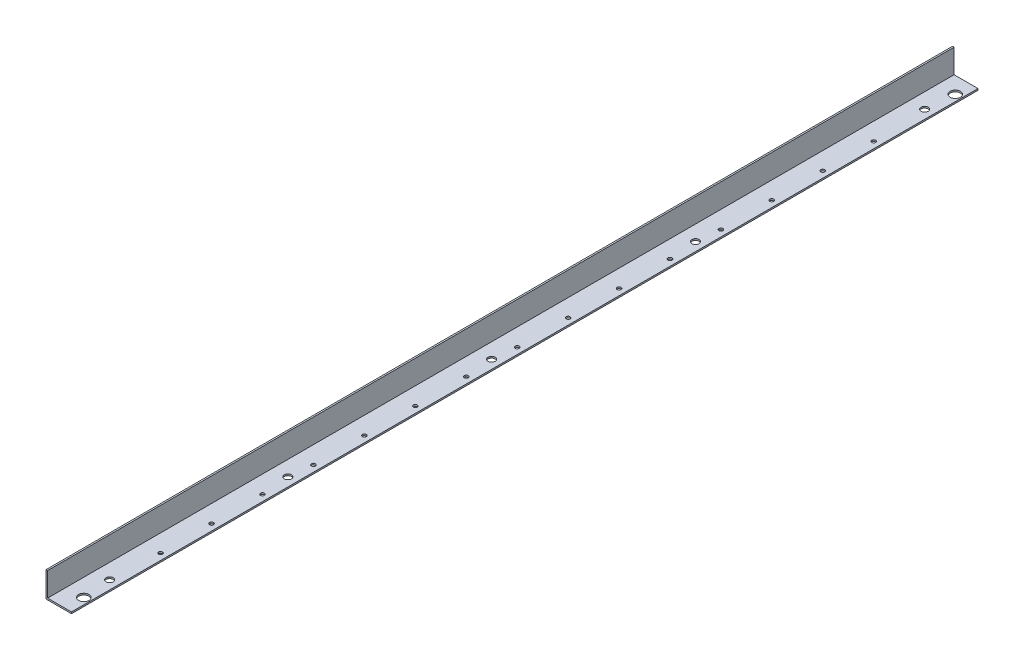
ISO-10303-21;
HEADER;
FILE_DESCRIPTION(('STEP AP214'),'2;1');
FILE_NAME('part.step','',(''),(''),'','','');
FILE_SCHEMA(('AUTOMOTIVE_DESIGN { 1 0 10303 214 1 1 1 1 }'));
ENDSEC;
DATA;
#1=APPLICATION_CONTEXT('core data for automotive mechanical design processes');
#2=APPLICATION_PROTOCOL_DEFINITION('international standard','automotive_design',2000,#1);
#3=PRODUCT_CONTEXT('',#1,'mechanical');
#4=PRODUCT('Part','Part','',(#3));
#5=PRODUCT_RELATED_PRODUCT_CATEGORY('part','',(#4));
#6=PRODUCT_DEFINITION_FORMATION('','',#4);
#7=PRODUCT_DEFINITION_CONTEXT('part definition',#1,'design');
#8=PRODUCT_DEFINITION('design','',#6,#7);
#9=PRODUCT_DEFINITION_SHAPE('','',#8);
#10=(LENGTH_UNIT() NAMED_UNIT(*) SI_UNIT(.MILLI.,.METRE.));
#11=(NAMED_UNIT(*) PLANE_ANGLE_UNIT() SI_UNIT($,.RADIAN.));
#12=(NAMED_UNIT(*) SI_UNIT($,.STERADIAN.) SOLID_ANGLE_UNIT());
#13=UNCERTAINTY_MEASURE_WITH_UNIT(LENGTH_MEASURE(1.E-05),#10,'distance_accuracy_value','');
#14=(GEOMETRIC_REPRESENTATION_CONTEXT(3) GLOBAL_UNCERTAINTY_ASSIGNED_CONTEXT((#13)) GLOBAL_UNIT_ASSIGNED_CONTEXT((#10,
#11,#12)) REPRESENTATION_CONTEXT('',''));
#15=CARTESIAN_POINT('',(0.,0.,0.));
#16=DIRECTION('',(0.,0.,1.));
#17=DIRECTION('',(1.,0.,0.));
#18=AXIS2_PLACEMENT_3D('',#15,#16,#17);
#19=CARTESIAN_POINT('',(38.1,0.,866.775));
#20=DIRECTION('',(0.,1.,0.));
#21=DIRECTION('',(0.,0.,1.));
#22=AXIS2_PLACEMENT_3D('',#19,#20,#21);
#23=CYLINDRICAL_SURFACE('',#22,10.31875);
#24=CARTESIAN_POINT('',(38.1,3.175,866.775));
#25=DIRECTION('',(0.,1.,0.));
#26=DIRECTION('',(0.,0.,1.));
#27=AXIS2_PLACEMENT_3D('',#24,#25,#26);
#28=CIRCLE('',#27,10.31875);
#29=CARTESIAN_POINT('',(38.1,3.175,877.09375));
#30=VERTEX_POINT('',#29);
#31=EDGE_CURVE('E20',#30,#30,#28,.F.);
#32=ORIENTED_EDGE('',*,*,#31,.F.);
#33=EDGE_LOOP('',(#32));
#34=FACE_BOUND('',#33,.T.);
#35=CARTESIAN_POINT('',(38.1,0.,866.775));
#36=DIRECTION('',(0.,1.,0.));
#37=DIRECTION('',(0.,0.,1.));
#38=AXIS2_PLACEMENT_3D('',#35,#36,#37);
#39=CIRCLE('',#38,10.31875);
#40=CARTESIAN_POINT('',(38.1,0.,877.09375));
#41=VERTEX_POINT('',#40);
#42=EDGE_CURVE('E101',#41,#41,#39,.T.);
#43=ORIENTED_EDGE('',*,*,#42,.F.);
#44=EDGE_LOOP('',(#43));
#45=FACE_BOUND('',#44,.T.);
#46=ADVANCED_FACE('F17',(#34,#45),#23,.F.);
#47=CARTESIAN_POINT('',(38.1,0.,-871.5375));
#48=DIRECTION('',(0.,1.,0.));
#49=DIRECTION('',(0.,0.,1.));
#50=AXIS2_PLACEMENT_3D('',#47,#48,#49);
#51=CYLINDRICAL_SURFACE('',#50,10.31875);
#52=CARTESIAN_POINT('',(38.1,3.175,-871.5375));
#53=DIRECTION('',(0.,1.,0.));
#54=DIRECTION('',(0.,0.,1.));
#55=AXIS2_PLACEMENT_3D('',#52,#53,#54);
#56=CIRCLE('',#55,10.31875);
#57=CARTESIAN_POINT('',(38.1,3.175,-861.21875));
#58=VERTEX_POINT('',#57);
#59=EDGE_CURVE('E223',#58,#58,#56,.F.);
#60=ORIENTED_EDGE('',*,*,#59,.F.);
#61=EDGE_LOOP('',(#60));
#62=FACE_BOUND('',#61,.T.);
#63=CARTESIAN_POINT('',(38.1,0.,-871.5375));
#64=DIRECTION('',(0.,1.,0.));
#65=DIRECTION('',(0.,0.,1.));
#66=AXIS2_PLACEMENT_3D('',#63,#64,#65);
#67=CIRCLE('',#66,10.31875);
#68=CARTESIAN_POINT('',(38.1,0.,-861.21875));
#69=VERTEX_POINT('',#68);
#70=EDGE_CURVE('E160',#69,#69,#67,.T.);
#71=ORIENTED_EDGE('',*,*,#70,.F.);
#72=EDGE_LOOP('',(#71));
#73=FACE_BOUND('',#72,.T.);
#74=ADVANCED_FACE('F233',(#62,#73),#51,.F.);
#75=CARTESIAN_POINT('',(33.3375,0.,810.41875));
#76=DIRECTION('',(0.,1.,0.));
#77=DIRECTION('',(0.,0.,1.));
#78=AXIS2_PLACEMENT_3D('',#75,#76,#77);
#79=CYLINDRICAL_SURFACE('',#78,7.14375);
#80=CARTESIAN_POINT('',(33.3375,3.175,810.41875));
#81=DIRECTION('',(0.,1.,0.));
#82=DIRECTION('',(0.,0.,1.));
#83=AXIS2_PLACEMENT_3D('',#80,#81,#82);
#84=CIRCLE('',#83,7.14375);
#85=CARTESIAN_POINT('',(33.3375,3.175,817.5625));
#86=VERTEX_POINT('',#85);
#87=EDGE_CURVE('E221',#86,#86,#84,.F.);
#88=ORIENTED_EDGE('',*,*,#87,.F.);
#89=EDGE_LOOP('',(#88));
#90=FACE_BOUND('',#89,.T.);
#91=CARTESIAN_POINT('',(33.3375,0.,810.41875));
#92=DIRECTION('',(0.,1.,0.));
#93=DIRECTION('',(0.,0.,1.));
#94=AXIS2_PLACEMENT_3D('',#91,#92,#93);
#95=CIRCLE('',#94,7.14375);
#96=CARTESIAN_POINT('',(33.3375,0.,817.5625));
#97=VERTEX_POINT('',#96);
#98=EDGE_CURVE('E157',#97,#97,#95,.T.);
#99=ORIENTED_EDGE('',*,*,#98,.F.);
#100=EDGE_LOOP('',(#99));
#101=FACE_BOUND('',#100,.T.);
#102=ADVANCED_FACE('F527',(#90,#101),#79,.F.);
#103=CARTESIAN_POINT('',(33.3375,0.,454.81875));
#104=DIRECTION('',(0.,1.,0.));
#105=DIRECTION('',(0.,0.,1.));
#106=AXIS2_PLACEMENT_3D('',#103,#104,#105);
#107=CYLINDRICAL_SURFACE('',#106,7.14375);
#108=CARTESIAN_POINT('',(33.3375,3.175,454.81875));
#109=DIRECTION('',(0.,1.,0.));
#110=DIRECTION('',(0.,0.,1.));
#111=AXIS2_PLACEMENT_3D('',#108,#109,#110);
#112=CIRCLE('',#111,7.14375);
#113=CARTESIAN_POINT('',(33.3375,3.175,461.9625));
#114=VERTEX_POINT('',#113);
#115=EDGE_CURVE('E218',#114,#114,#112,.F.);
#116=ORIENTED_EDGE('',*,*,#115,.F.);
#117=EDGE_LOOP('',(#116));
#118=FACE_BOUND('',#117,.T.);
#119=CARTESIAN_POINT('',(33.3375,0.,454.81875));
#120=DIRECTION('',(0.,1.,0.));
#121=DIRECTION('',(0.,0.,1.));
#122=AXIS2_PLACEMENT_3D('',#119,#120,#121);
#123=CIRCLE('',#122,7.14375);
#124=CARTESIAN_POINT('',(33.3375,0.,461.9625));
#125=VERTEX_POINT('',#124);
#126=EDGE_CURVE('E154',#125,#125,#123,.T.);
#127=ORIENTED_EDGE('',*,*,#126,.F.);
#128=EDGE_LOOP('',(#127));
#129=FACE_BOUND('',#128,.T.);
#130=ADVANCED_FACE('F517',(#118,#129),#107,.F.);
#131=CARTESIAN_POINT('',(33.3375,0.,48.64735));
#132=DIRECTION('',(0.,1.,0.));
#133=DIRECTION('',(0.,0.,1.));
#134=AXIS2_PLACEMENT_3D('',#131,#132,#133);
#135=CYLINDRICAL_SURFACE('',#134,7.14375);
#136=CARTESIAN_POINT('',(33.3375,3.175,48.64735));
#137=DIRECTION('',(0.,1.,0.));
#138=DIRECTION('',(0.,0.,1.));
#139=AXIS2_PLACEMENT_3D('',#136,#137,#138);
#140=CIRCLE('',#139,7.14375);
#141=CARTESIAN_POINT('',(33.3375,3.175,55.7911));
#142=VERTEX_POINT('',#141);
#143=EDGE_CURVE('E215',#142,#142,#140,.F.);
#144=ORIENTED_EDGE('',*,*,#143,.F.);
#145=EDGE_LOOP('',(#144));
#146=FACE_BOUND('',#145,.T.);
#147=CARTESIAN_POINT('',(33.3375,0.,48.64735));
#148=DIRECTION('',(0.,1.,0.));
#149=DIRECTION('',(0.,0.,1.));
#150=AXIS2_PLACEMENT_3D('',#147,#148,#149);
#151=CIRCLE('',#150,7.14375);
#152=CARTESIAN_POINT('',(33.3375,0.,55.7911));
#153=VERTEX_POINT('',#152);
#154=EDGE_CURVE('E151',#153,#153,#151,.T.);
#155=ORIENTED_EDGE('',*,*,#154,.F.);
#156=EDGE_LOOP('',(#155));
#157=FACE_BOUND('',#156,.T.);
#158=ADVANCED_FACE('F507',(#146,#157),#135,.F.);
#159=CARTESIAN_POINT('',(33.3375,0.,-357.98125));
#160=DIRECTION('',(0.,1.,0.));
#161=DIRECTION('',(0.,0.,1.));
#162=AXIS2_PLACEMENT_3D('',#159,#160,#161);
#163=CYLINDRICAL_SURFACE('',#162,7.14375);
#164=CARTESIAN_POINT('',(33.3375,3.175,-357.98125));
#165=DIRECTION('',(0.,1.,0.));
#166=DIRECTION('',(0.,0.,1.));
#167=AXIS2_PLACEMENT_3D('',#164,#165,#166);
#168=CIRCLE('',#167,7.14375);
#169=CARTESIAN_POINT('',(33.3375,3.175,-350.8375));
#170=VERTEX_POINT('',#169);
#171=EDGE_CURVE('E212',#170,#170,#168,.F.);
#172=ORIENTED_EDGE('',*,*,#171,.F.);
#173=EDGE_LOOP('',(#172));
#174=FACE_BOUND('',#173,.T.);
#175=CARTESIAN_POINT('',(33.3375,0.,-357.98125));
#176=DIRECTION('',(0.,1.,0.));
#177=DIRECTION('',(0.,0.,1.));
#178=AXIS2_PLACEMENT_3D('',#175,#176,#177);
#179=CIRCLE('',#178,7.14375);
#180=CARTESIAN_POINT('',(33.3375,0.,-350.8375));
#181=VERTEX_POINT('',#180);
#182=EDGE_CURVE('E148',#181,#181,#179,.T.);
#183=ORIENTED_EDGE('',*,*,#182,.F.);
#184=EDGE_LOOP('',(#183));
#185=FACE_BOUND('',#184,.T.);
#186=ADVANCED_FACE('F497',(#174,#185),#163,.F.);
#187=CARTESIAN_POINT('',(33.3375,0.,-815.18125));
#188=DIRECTION('',(0.,1.,0.));
#189=DIRECTION('',(0.,0.,1.));
#190=AXIS2_PLACEMENT_3D('',#187,#188,#189);
#191=CYLINDRICAL_SURFACE('',#190,7.14375);
#192=CARTESIAN_POINT('',(33.3375,3.175,-815.18125));
#193=DIRECTION('',(0.,1.,0.));
#194=DIRECTION('',(0.,0.,1.));
#195=AXIS2_PLACEMENT_3D('',#192,#193,#194);
#196=CIRCLE('',#195,7.14375);
#197=CARTESIAN_POINT('',(33.3375,3.175,-808.0375));
#198=VERTEX_POINT('',#197);
#199=EDGE_CURVE('E209',#198,#198,#196,.F.);
#200=ORIENTED_EDGE('',*,*,#199,.F.);
#201=EDGE_LOOP('',(#200));
#202=FACE_BOUND('',#201,.T.);
#203=CARTESIAN_POINT('',(33.3375,0.,-815.18125));
#204=DIRECTION('',(0.,1.,0.));
#205=DIRECTION('',(0.,0.,1.));
#206=AXIS2_PLACEMENT_3D('',#203,#204,#205);
#207=CIRCLE('',#206,7.14375);
#208=CARTESIAN_POINT('',(33.3375,0.,-808.0375));
#209=VERTEX_POINT('',#208);
#210=EDGE_CURVE('E145',#209,#209,#207,.T.);
#211=ORIENTED_EDGE('',*,*,#210,.F.);
#212=EDGE_LOOP('',(#211));
#213=FACE_BOUND('',#212,.T.);
#214=ADVANCED_FACE('F487',(#202,#213),#191,.F.);
#215=CARTESIAN_POINT('',(38.1,0.,-708.81875));
#216=DIRECTION('',(0.,-1.,0.));
#217=DIRECTION('',(0.,0.,-1.));
#218=AXIS2_PLACEMENT_3D('',#215,#216,#217);
#219=CYLINDRICAL_SURFACE('',#218,3.96875);
#220=CARTESIAN_POINT('',(38.1,3.175,-708.81875));
#221=DIRECTION('',(0.,-1.,0.));
#222=DIRECTION('',(0.,0.,-1.));
#223=AXIS2_PLACEMENT_3D('',#220,#221,#222);
#224=CIRCLE('',#223,3.96875);
#225=CARTESIAN_POINT('',(38.1,3.175,-712.7875));
#226=VERTEX_POINT('',#225);
#227=EDGE_CURVE('E206',#226,#226,#224,.T.);
#228=ORIENTED_EDGE('',*,*,#227,.F.);
#229=EDGE_LOOP('',(#228));
#230=FACE_BOUND('',#229,.T.);
#231=CARTESIAN_POINT('',(38.1,0.,-708.81875));
#232=DIRECTION('',(0.,-1.,0.));
#233=DIRECTION('',(0.,0.,-1.));
#234=AXIS2_PLACEMENT_3D('',#231,#232,#233);
#235=CIRCLE('',#234,3.96875);
#236=CARTESIAN_POINT('',(38.1,0.,-712.7875));
#237=VERTEX_POINT('',#236);
#238=EDGE_CURVE('E142',#237,#237,#235,.F.);
#239=ORIENTED_EDGE('',*,*,#238,.F.);
#240=EDGE_LOOP('',(#239));
#241=FACE_BOUND('',#240,.T.);
#242=ADVANCED_FACE('F477',(#230,#241),#219,.F.);
#243=CARTESIAN_POINT('',(38.1,0.,-607.21875));
#244=DIRECTION('',(0.,-1.,0.));
#245=DIRECTION('',(0.,0.,-1.));
#246=AXIS2_PLACEMENT_3D('',#243,#244,#245);
#247=CYLINDRICAL_SURFACE('',#246,3.96875);
#248=CARTESIAN_POINT('',(38.1,3.175,-607.21875));
#249=DIRECTION('',(0.,-1.,0.));
#250=DIRECTION('',(0.,0.,-1.));
#251=AXIS2_PLACEMENT_3D('',#248,#249,#250);
#252=CIRCLE('',#251,3.96875);
#253=CARTESIAN_POINT('',(38.1,3.175,-611.1875));
#254=VERTEX_POINT('',#253);
#255=EDGE_CURVE('E203',#254,#254,#252,.T.);
#256=ORIENTED_EDGE('',*,*,#255,.F.);
#257=EDGE_LOOP('',(#256));
#258=FACE_BOUND('',#257,.T.);
#259=CARTESIAN_POINT('',(38.1,0.,-607.21875));
#260=DIRECTION('',(0.,-1.,0.));
#261=DIRECTION('',(0.,0.,-1.));
#262=AXIS2_PLACEMENT_3D('',#259,#260,#261);
#263=CIRCLE('',#262,3.96875);
#264=CARTESIAN_POINT('',(38.1,0.,-611.1875));
#265=VERTEX_POINT('',#264);
#266=EDGE_CURVE('E139',#265,#265,#263,.F.);
#267=ORIENTED_EDGE('',*,*,#266,.F.);
#268=EDGE_LOOP('',(#267));
#269=FACE_BOUND('',#268,.T.);
#270=ADVANCED_FACE('F467',(#258,#269),#247,.F.);
#271=CARTESIAN_POINT('',(38.1,0.,-505.61875));
#272=DIRECTION('',(0.,-1.,0.));
#273=DIRECTION('',(0.,0.,-1.));
#274=AXIS2_PLACEMENT_3D('',#271,#272,#273);
#275=CYLINDRICAL_SURFACE('',#274,3.96875);
#276=CARTESIAN_POINT('',(38.1,3.175,-505.61875));
#277=DIRECTION('',(0.,-1.,0.));
#278=DIRECTION('',(0.,0.,-1.));
#279=AXIS2_PLACEMENT_3D('',#276,#277,#278);
#280=CIRCLE('',#279,3.96875);
#281=CARTESIAN_POINT('',(38.1,3.175,-509.5875));
#282=VERTEX_POINT('',#281);
#283=EDGE_CURVE('E200',#282,#282,#280,.T.);
#284=ORIENTED_EDGE('',*,*,#283,.F.);
#285=EDGE_LOOP('',(#284));
#286=FACE_BOUND('',#285,.T.);
#287=CARTESIAN_POINT('',(38.1,0.,-505.61875));
#288=DIRECTION('',(0.,-1.,0.));
#289=DIRECTION('',(0.,0.,-1.));
#290=AXIS2_PLACEMENT_3D('',#287,#288,#289);
#291=CIRCLE('',#290,3.96875);
#292=CARTESIAN_POINT('',(38.1,0.,-509.5875));
#293=VERTEX_POINT('',#292);
#294=EDGE_CURVE('E136',#293,#293,#291,.F.);
#295=ORIENTED_EDGE('',*,*,#294,.F.);
#296=EDGE_LOOP('',(#295));
#297=FACE_BOUND('',#296,.T.);
#298=ADVANCED_FACE('F457',(#286,#297),#275,.F.);
#299=CARTESIAN_POINT('',(38.1,0.,-404.01875));
#300=DIRECTION('',(0.,-1.,0.));
#301=DIRECTION('',(0.,0.,-1.));
#302=AXIS2_PLACEMENT_3D('',#299,#300,#301);
#303=CYLINDRICAL_SURFACE('',#302,3.96875);
#304=CARTESIAN_POINT('',(38.1,3.175,-404.01875));
#305=DIRECTION('',(0.,-1.,0.));
#306=DIRECTION('',(0.,0.,-1.));
#307=AXIS2_PLACEMENT_3D('',#304,#305,#306);
#308=CIRCLE('',#307,3.96875);
#309=CARTESIAN_POINT('',(38.1,3.175,-407.9875));
#310=VERTEX_POINT('',#309);
#311=EDGE_CURVE('E197',#310,#310,#308,.T.);
#312=ORIENTED_EDGE('',*,*,#311,.F.);
#313=EDGE_LOOP('',(#312));
#314=FACE_BOUND('',#313,.T.);
#315=CARTESIAN_POINT('',(38.1,0.,-404.01875));
#316=DIRECTION('',(0.,-1.,0.));
#317=DIRECTION('',(0.,0.,-1.));
#318=AXIS2_PLACEMENT_3D('',#315,#316,#317);
#319=CIRCLE('',#318,3.96875);
#320=CARTESIAN_POINT('',(38.1,0.,-407.9875));
#321=VERTEX_POINT('',#320);
#322=EDGE_CURVE('E133',#321,#321,#319,.F.);
#323=ORIENTED_EDGE('',*,*,#322,.F.);
#324=EDGE_LOOP('',(#323));
#325=FACE_BOUND('',#324,.T.);
#326=ADVANCED_FACE('F447',(#314,#325),#303,.F.);
#327=CARTESIAN_POINT('',(38.1,0.,-302.41875));
#328=DIRECTION('',(0.,-1.,0.));
#329=DIRECTION('',(0.,0.,-1.));
#330=AXIS2_PLACEMENT_3D('',#327,#328,#329);
#331=CYLINDRICAL_SURFACE('',#330,3.96875);
#332=CARTESIAN_POINT('',(38.1,3.175,-302.41875));
#333=DIRECTION('',(0.,-1.,0.));
#334=DIRECTION('',(0.,0.,-1.));
#335=AXIS2_PLACEMENT_3D('',#332,#333,#334);
#336=CIRCLE('',#335,3.96875);
#337=CARTESIAN_POINT('',(38.1,3.175,-306.3875));
#338=VERTEX_POINT('',#337);
#339=EDGE_CURVE('E194',#338,#338,#336,.T.);
#340=ORIENTED_EDGE('',*,*,#339,.F.);
#341=EDGE_LOOP('',(#340));
#342=FACE_BOUND('',#341,.T.);
#343=CARTESIAN_POINT('',(38.1,0.,-302.41875));
#344=DIRECTION('',(0.,-1.,0.));
#345=DIRECTION('',(0.,0.,-1.));
#346=AXIS2_PLACEMENT_3D('',#343,#344,#345);
#347=CIRCLE('',#346,3.96875);
#348=CARTESIAN_POINT('',(38.1,0.,-306.3875));
#349=VERTEX_POINT('',#348);
#350=EDGE_CURVE('E130',#349,#349,#347,.F.);
#351=ORIENTED_EDGE('',*,*,#350,.F.);
#352=EDGE_LOOP('',(#351));
#353=FACE_BOUND('',#352,.T.);
#354=ADVANCED_FACE('F437',(#342,#353),#331,.F.);
#355=CARTESIAN_POINT('',(38.1,0.,-200.81875));
#356=DIRECTION('',(0.,-1.,0.));
#357=DIRECTION('',(0.,0.,-1.));
#358=AXIS2_PLACEMENT_3D('',#355,#356,#357);
#359=CYLINDRICAL_SURFACE('',#358,3.96875);
#360=CARTESIAN_POINT('',(38.1,3.175,-200.81875));
#361=DIRECTION('',(0.,-1.,0.));
#362=DIRECTION('',(0.,0.,-1.));
#363=AXIS2_PLACEMENT_3D('',#360,#361,#362);
#364=CIRCLE('',#363,3.96875);
#365=CARTESIAN_POINT('',(38.1,3.175,-204.7875));
#366=VERTEX_POINT('',#365);
#367=EDGE_CURVE('E191',#366,#366,#364,.T.);
#368=ORIENTED_EDGE('',*,*,#367,.F.);
#369=EDGE_LOOP('',(#368));
#370=FACE_BOUND('',#369,.T.);
#371=CARTESIAN_POINT('',(38.1,0.,-200.81875));
#372=DIRECTION('',(0.,-1.,0.));
#373=DIRECTION('',(0.,0.,-1.));
#374=AXIS2_PLACEMENT_3D('',#371,#372,#373);
#375=CIRCLE('',#374,3.96875);
#376=CARTESIAN_POINT('',(38.1,0.,-204.7875));
#377=VERTEX_POINT('',#376);
#378=EDGE_CURVE('E127',#377,#377,#375,.F.);
#379=ORIENTED_EDGE('',*,*,#378,.F.);
#380=EDGE_LOOP('',(#379));
#381=FACE_BOUND('',#380,.T.);
#382=ADVANCED_FACE('F427',(#370,#381),#359,.F.);
#383=CARTESIAN_POINT('',(38.1,0.,-99.21875));
#384=DIRECTION('',(0.,-1.,0.));
#385=DIRECTION('',(0.,0.,-1.));
#386=AXIS2_PLACEMENT_3D('',#383,#384,#385);
#387=CYLINDRICAL_SURFACE('',#386,3.96875);
#388=CARTESIAN_POINT('',(38.1,3.175,-99.21875));
#389=DIRECTION('',(0.,-1.,0.));
#390=DIRECTION('',(0.,0.,-1.));
#391=AXIS2_PLACEMENT_3D('',#388,#389,#390);
#392=CIRCLE('',#391,3.96875);
#393=CARTESIAN_POINT('',(38.1,3.175,-103.1875));
#394=VERTEX_POINT('',#393);
#395=EDGE_CURVE('E188',#394,#394,#392,.T.);
#396=ORIENTED_EDGE('',*,*,#395,.F.);
#397=EDGE_LOOP('',(#396));
#398=FACE_BOUND('',#397,.T.);
#399=CARTESIAN_POINT('',(38.1,0.,-99.21875));
#400=DIRECTION('',(0.,-1.,0.));
#401=DIRECTION('',(0.,0.,-1.));
#402=AXIS2_PLACEMENT_3D('',#399,#400,#401);
#403=CIRCLE('',#402,3.96875);
#404=CARTESIAN_POINT('',(38.1,0.,-103.1875));
#405=VERTEX_POINT('',#404);
#406=EDGE_CURVE('E124',#405,#405,#403,.F.);
#407=ORIENTED_EDGE('',*,*,#406,.F.);
#408=EDGE_LOOP('',(#407));
#409=FACE_BOUND('',#408,.T.);
#410=ADVANCED_FACE('F417',(#398,#409),#387,.F.);
#411=CARTESIAN_POINT('',(38.1,0.,2.38125));
#412=DIRECTION('',(0.,-1.,0.));
#413=DIRECTION('',(0.,0.,-1.));
#414=AXIS2_PLACEMENT_3D('',#411,#412,#413);
#415=CYLINDRICAL_SURFACE('',#414,3.96875);
#416=CARTESIAN_POINT('',(38.1,3.175,2.38125));
#417=DIRECTION('',(0.,-1.,0.));
#418=DIRECTION('',(0.,0.,-1.));
#419=AXIS2_PLACEMENT_3D('',#416,#417,#418);
#420=CIRCLE('',#419,3.96875);
#421=CARTESIAN_POINT('',(38.1,3.175,-1.5875));
#422=VERTEX_POINT('',#421);
#423=EDGE_CURVE('E185',#422,#422,#420,.T.);
#424=ORIENTED_EDGE('',*,*,#423,.F.);
#425=EDGE_LOOP('',(#424));
#426=FACE_BOUND('',#425,.T.);
#427=CARTESIAN_POINT('',(38.1,0.,2.38125));
#428=DIRECTION('',(0.,-1.,0.));
#429=DIRECTION('',(0.,0.,-1.));
#430=AXIS2_PLACEMENT_3D('',#427,#428,#429);
#431=CIRCLE('',#430,3.96875);
#432=CARTESIAN_POINT('',(38.1,0.,-1.5875));
#433=VERTEX_POINT('',#432);
#434=EDGE_CURVE('E121',#433,#433,#431,.F.);
#435=ORIENTED_EDGE('',*,*,#434,.F.);
#436=EDGE_LOOP('',(#435));
#437=FACE_BOUND('',#436,.T.);
#438=ADVANCED_FACE('F407',(#426,#437),#415,.F.);
#439=CARTESIAN_POINT('',(38.1,0.,103.98125));
#440=DIRECTION('',(0.,-1.,0.));
#441=DIRECTION('',(0.,0.,-1.));
#442=AXIS2_PLACEMENT_3D('',#439,#440,#441);
#443=CYLINDRICAL_SURFACE('',#442,3.96875);
#444=CARTESIAN_POINT('',(38.1,3.175,103.98125));
#445=DIRECTION('',(0.,-1.,0.));
#446=DIRECTION('',(0.,0.,-1.));
#447=AXIS2_PLACEMENT_3D('',#444,#445,#446);
#448=CIRCLE('',#447,3.96875);
#449=CARTESIAN_POINT('',(38.1,3.175,100.0125));
#450=VERTEX_POINT('',#449);
#451=EDGE_CURVE('E182',#450,#450,#448,.T.);
#452=ORIENTED_EDGE('',*,*,#451,.F.);
#453=EDGE_LOOP('',(#452));
#454=FACE_BOUND('',#453,.T.);
#455=CARTESIAN_POINT('',(38.1,0.,103.98125));
#456=DIRECTION('',(0.,-1.,0.));
#457=DIRECTION('',(0.,0.,-1.));
#458=AXIS2_PLACEMENT_3D('',#455,#456,#457);
#459=CIRCLE('',#458,3.96875);
#460=CARTESIAN_POINT('',(38.1,0.,100.0125));
#461=VERTEX_POINT('',#460);
#462=EDGE_CURVE('E118',#461,#461,#459,.F.);
#463=ORIENTED_EDGE('',*,*,#462,.F.);
#464=EDGE_LOOP('',(#463));
#465=FACE_BOUND('',#464,.T.);
#466=ADVANCED_FACE('F397',(#454,#465),#443,.F.);
#467=CARTESIAN_POINT('',(38.1,0.,205.58125));
#468=DIRECTION('',(0.,-1.,0.));
#469=DIRECTION('',(0.,0.,-1.));
#470=AXIS2_PLACEMENT_3D('',#467,#468,#469);
#471=CYLINDRICAL_SURFACE('',#470,3.96875);
#472=CARTESIAN_POINT('',(38.1,3.175,205.58125));
#473=DIRECTION('',(0.,-1.,0.));
#474=DIRECTION('',(0.,0.,-1.));
#475=AXIS2_PLACEMENT_3D('',#472,#473,#474);
#476=CIRCLE('',#475,3.96875);
#477=CARTESIAN_POINT('',(38.1,3.175,201.6125));
#478=VERTEX_POINT('',#477);
#479=EDGE_CURVE('E179',#478,#478,#476,.T.);
#480=ORIENTED_EDGE('',*,*,#479,.F.);
#481=EDGE_LOOP('',(#480));
#482=FACE_BOUND('',#481,.T.);
#483=CARTESIAN_POINT('',(38.1,0.,205.58125));
#484=DIRECTION('',(0.,-1.,0.));
#485=DIRECTION('',(0.,0.,-1.));
#486=AXIS2_PLACEMENT_3D('',#483,#484,#485);
#487=CIRCLE('',#486,3.96875);
#488=CARTESIAN_POINT('',(38.1,0.,201.6125));
#489=VERTEX_POINT('',#488);
#490=EDGE_CURVE('E115',#489,#489,#487,.F.);
#491=ORIENTED_EDGE('',*,*,#490,.F.);
#492=EDGE_LOOP('',(#491));
#493=FACE_BOUND('',#492,.T.);
#494=ADVANCED_FACE('F387',(#482,#493),#471,.F.);
#495=CARTESIAN_POINT('',(38.1,0.,307.18125));
#496=DIRECTION('',(0.,-1.,0.));
#497=DIRECTION('',(0.,0.,-1.));
#498=AXIS2_PLACEMENT_3D('',#495,#496,#497);
#499=CYLINDRICAL_SURFACE('',#498,3.96875);
#500=CARTESIAN_POINT('',(38.1,3.175,307.18125));
#501=DIRECTION('',(0.,-1.,0.));
#502=DIRECTION('',(0.,0.,-1.));
#503=AXIS2_PLACEMENT_3D('',#500,#501,#502);
#504=CIRCLE('',#503,3.96875);
#505=CARTESIAN_POINT('',(38.1,3.175,303.2125));
#506=VERTEX_POINT('',#505);
#507=EDGE_CURVE('E176',#506,#506,#504,.T.);
#508=ORIENTED_EDGE('',*,*,#507,.F.);
#509=EDGE_LOOP('',(#508));
#510=FACE_BOUND('',#509,.T.);
#511=CARTESIAN_POINT('',(38.1,0.,307.18125));
#512=DIRECTION('',(0.,-1.,0.));
#513=DIRECTION('',(0.,0.,-1.));
#514=AXIS2_PLACEMENT_3D('',#511,#512,#513);
#515=CIRCLE('',#514,3.96875);
#516=CARTESIAN_POINT('',(38.1,0.,303.2125));
#517=VERTEX_POINT('',#516);
#518=EDGE_CURVE('E112',#517,#517,#515,.F.);
#519=ORIENTED_EDGE('',*,*,#518,.F.);
#520=EDGE_LOOP('',(#519));
#521=FACE_BOUND('',#520,.T.);
#522=ADVANCED_FACE('F377',(#510,#521),#499,.F.);
#523=CARTESIAN_POINT('',(38.1,0.,408.78125));
#524=DIRECTION('',(0.,-1.,0.));
#525=DIRECTION('',(0.,0.,-1.));
#526=AXIS2_PLACEMENT_3D('',#523,#524,#525);
#527=CYLINDRICAL_SURFACE('',#526,3.96875);
#528=CARTESIAN_POINT('',(38.1,3.175,408.78125));
#529=DIRECTION('',(0.,-1.,0.));
#530=DIRECTION('',(0.,0.,-1.));
#531=AXIS2_PLACEMENT_3D('',#528,#529,#530);
#532=CIRCLE('',#531,3.96875);
#533=CARTESIAN_POINT('',(38.1,3.175,404.8125));
#534=VERTEX_POINT('',#533);
#535=EDGE_CURVE('E173',#534,#534,#532,.T.);
#536=ORIENTED_EDGE('',*,*,#535,.F.);
#537=EDGE_LOOP('',(#536));
#538=FACE_BOUND('',#537,.T.);
#539=CARTESIAN_POINT('',(38.1,0.,408.78125));
#540=DIRECTION('',(0.,-1.,0.));
#541=DIRECTION('',(0.,0.,-1.));
#542=AXIS2_PLACEMENT_3D('',#539,#540,#541);
#543=CIRCLE('',#542,3.96875);
#544=CARTESIAN_POINT('',(38.1,0.,404.8125));
#545=VERTEX_POINT('',#544);
#546=EDGE_CURVE('E109',#545,#545,#543,.F.);
#547=ORIENTED_EDGE('',*,*,#546,.F.);
#548=EDGE_LOOP('',(#547));
#549=FACE_BOUND('',#548,.T.);
#550=ADVANCED_FACE('F367',(#538,#549),#527,.F.);
#551=CARTESIAN_POINT('',(38.1,0.,510.38125));
#552=DIRECTION('',(0.,-1.,0.));
#553=DIRECTION('',(0.,0.,-1.));
#554=AXIS2_PLACEMENT_3D('',#551,#552,#553);
#555=CYLINDRICAL_SURFACE('',#554,3.96875);
#556=CARTESIAN_POINT('',(38.1,3.175,510.38125));
#557=DIRECTION('',(0.,-1.,0.));
#558=DIRECTION('',(0.,0.,-1.));
#559=AXIS2_PLACEMENT_3D('',#556,#557,#558);
#560=CIRCLE('',#559,3.96875);
#561=CARTESIAN_POINT('',(38.1,3.175,506.4125));
#562=VERTEX_POINT('',#561);
#563=EDGE_CURVE('E170',#562,#562,#560,.T.);
#564=ORIENTED_EDGE('',*,*,#563,.F.);
#565=EDGE_LOOP('',(#564));
#566=FACE_BOUND('',#565,.T.);
#567=CARTESIAN_POINT('',(38.1,0.,510.38125));
#568=DIRECTION('',(0.,-1.,0.));
#569=DIRECTION('',(0.,0.,-1.));
#570=AXIS2_PLACEMENT_3D('',#567,#568,#569);
#571=CIRCLE('',#570,3.96875);
#572=CARTESIAN_POINT('',(38.1,0.,506.4125));
#573=VERTEX_POINT('',#572);
#574=EDGE_CURVE('E106',#573,#573,#571,.F.);
#575=ORIENTED_EDGE('',*,*,#574,.F.);
#576=EDGE_LOOP('',(#575));
#577=FACE_BOUND('',#576,.T.);
#578=ADVANCED_FACE('F357',(#566,#577),#555,.F.);
#579=CARTESIAN_POINT('',(38.1,0.,611.98125));
#580=DIRECTION('',(0.,-1.,0.));
#581=DIRECTION('',(0.,0.,-1.));
#582=AXIS2_PLACEMENT_3D('',#579,#580,#581);
#583=CYLINDRICAL_SURFACE('',#582,3.96875);
#584=CARTESIAN_POINT('',(38.1,3.175,611.98125));
#585=DIRECTION('',(0.,-1.,0.));
#586=DIRECTION('',(0.,0.,-1.));
#587=AXIS2_PLACEMENT_3D('',#584,#585,#586);
#588=CIRCLE('',#587,3.96875);
#589=CARTESIAN_POINT('',(38.1,3.175,608.0125));
#590=VERTEX_POINT('',#589);
#591=EDGE_CURVE('E167',#590,#590,#588,.T.);
#592=ORIENTED_EDGE('',*,*,#591,.F.);
#593=EDGE_LOOP('',(#592));
#594=FACE_BOUND('',#593,.T.);
#595=CARTESIAN_POINT('',(38.1,0.,611.98125));
#596=DIRECTION('',(0.,-1.,0.));
#597=DIRECTION('',(0.,0.,-1.));
#598=AXIS2_PLACEMENT_3D('',#595,#596,#597);
#599=CIRCLE('',#598,3.96875);
#600=CARTESIAN_POINT('',(38.1,0.,608.0125));
#601=VERTEX_POINT('',#600);
#602=EDGE_CURVE('E95',#601,#601,#599,.F.);
#603=ORIENTED_EDGE('',*,*,#602,.F.);
#604=EDGE_LOOP('',(#603));
#605=FACE_BOUND('',#604,.T.);
#606=ADVANCED_FACE('F347',(#594,#605),#583,.F.);
#607=CARTESIAN_POINT('',(38.1,0.,713.58125));
#608=DIRECTION('',(0.,-1.,0.));
#609=DIRECTION('',(0.,0.,-1.));
#610=AXIS2_PLACEMENT_3D('',#607,#608,#609);
#611=CYLINDRICAL_SURFACE('',#610,3.96875);
#612=CARTESIAN_POINT('',(38.1,3.175,713.58125));
#613=DIRECTION('',(0.,-1.,0.));
#614=DIRECTION('',(0.,0.,-1.));
#615=AXIS2_PLACEMENT_3D('',#612,#613,#614);
#616=CIRCLE('',#615,3.96875);
#617=CARTESIAN_POINT('',(38.1,3.175,709.6125));
#618=VERTEX_POINT('',#617);
#619=EDGE_CURVE('E102',#618,#618,#616,.T.);
#620=ORIENTED_EDGE('',*,*,#619,.F.);
#621=EDGE_LOOP('',(#620));
#622=FACE_BOUND('',#621,.T.);
#623=CARTESIAN_POINT('',(38.1,0.,713.58125));
#624=DIRECTION('',(0.,-1.,0.));
#625=DIRECTION('',(0.,0.,-1.));
#626=AXIS2_PLACEMENT_3D('',#623,#624,#625);
#627=CIRCLE('',#626,3.96875);
#628=CARTESIAN_POINT('',(38.1,0.,709.6125));
#629=VERTEX_POINT('',#628);
#630=EDGE_CURVE('E92',#629,#629,#627,.F.);
#631=ORIENTED_EDGE('',*,*,#630,.F.);
#632=EDGE_LOOP('',(#631));
#633=FACE_BOUND('',#632,.T.);
#634=ADVANCED_FACE('F338',(#622,#633),#611,.F.);
#635=CARTESIAN_POINT('',(50.8,0.,-904.08125));
#636=DIRECTION('',(1.,0.,0.));
#637=DIRECTION('',(0.,0.,-1.));
#638=AXIS2_PLACEMENT_3D('',#635,#636,#637);
#639=PLANE('',#638);
#640=DIRECTION('',(0.,0.,-1.));
#641=VECTOR('',#640,1.);
#642=CARTESIAN_POINT('',(50.8,0.,-904.08125));
#643=LINE('',#642,#641);
#644=CARTESIAN_POINT('',(50.8,0.,-904.08125));
#645=VERTEX_POINT('',#644);
#646=CARTESIAN_POINT('',(50.8,0.,904.08125));
#647=VERTEX_POINT('',#646);
#648=EDGE_CURVE('E99',#645,#647,#643,.F.);
#649=ORIENTED_EDGE('',*,*,#648,.F.);
#650=DIRECTION('',(0.,1.,0.));
#651=VECTOR('',#650,1.);
#652=CARTESIAN_POINT('',(50.8,0.,-904.08125));
#653=LINE('',#652,#651);
#654=CARTESIAN_POINT('',(50.8,3.175,-904.08125));
#655=VERTEX_POINT('',#654);
#656=EDGE_CURVE('E75',#645,#655,#653,.T.);
#657=ORIENTED_EDGE('',*,*,#656,.T.);
#658=DIRECTION('',(0.,0.,1.));
#659=VECTOR('',#658,1.);
#660=CARTESIAN_POINT('',(50.8,3.175,-904.08125));
#661=LINE('',#660,#659);
#662=CARTESIAN_POINT('',(50.8,3.175,904.08125));
#663=VERTEX_POINT('',#662);
#664=EDGE_CURVE('E71',#663,#655,#661,.F.);
#665=ORIENTED_EDGE('',*,*,#664,.F.);
#666=DIRECTION('',(0.,1.,0.));
#667=VECTOR('',#666,1.);
#668=CARTESIAN_POINT('',(50.8,0.,904.08125));
#669=LINE('',#668,#667);
#670=EDGE_CURVE('E68',#647,#663,#669,.T.);
#671=ORIENTED_EDGE('',*,*,#670,.F.);
#672=EDGE_LOOP('',(#649,#657,#665,#671));
#673=FACE_BOUND('',#672,.T.);
#674=ADVANCED_FACE('F73',(#673),#639,.T.);
#675=CARTESIAN_POINT('',(50.8,3.175,-904.08125));
#676=DIRECTION('',(0.,1.,0.));
#677=DIRECTION('',(0.,0.,1.));
#678=AXIS2_PLACEMENT_3D('',#675,#676,#677);
#679=PLANE('',#678);
#680=ORIENTED_EDGE('',*,*,#619,.T.);
#681=EDGE_LOOP('',(#680));
#682=FACE_BOUND('',#681,.T.);
#683=ORIENTED_EDGE('',*,*,#591,.T.);
#684=EDGE_LOOP('',(#683));
#685=FACE_BOUND('',#684,.T.);
#686=ORIENTED_EDGE('',*,*,#563,.T.);
#687=EDGE_LOOP('',(#686));
#688=FACE_BOUND('',#687,.T.);
#689=ORIENTED_EDGE('',*,*,#535,.T.);
#690=EDGE_LOOP('',(#689));
#691=FACE_BOUND('',#690,.T.);
#692=ORIENTED_EDGE('',*,*,#507,.T.);
#693=EDGE_LOOP('',(#692));
#694=FACE_BOUND('',#693,.T.);
#695=ORIENTED_EDGE('',*,*,#479,.T.);
#696=EDGE_LOOP('',(#695));
#697=FACE_BOUND('',#696,.T.);
#698=ORIENTED_EDGE('',*,*,#451,.T.);
#699=EDGE_LOOP('',(#698));
#700=FACE_BOUND('',#699,.T.);
#701=ORIENTED_EDGE('',*,*,#423,.T.);
#702=EDGE_LOOP('',(#701));
#703=FACE_BOUND('',#702,.T.);
#704=ORIENTED_EDGE('',*,*,#395,.T.);
#705=EDGE_LOOP('',(#704));
#706=FACE_BOUND('',#705,.T.);
#707=ORIENTED_EDGE('',*,*,#367,.T.);
#708=EDGE_LOOP('',(#707));
#709=FACE_BOUND('',#708,.T.);
#710=ORIENTED_EDGE('',*,*,#339,.T.);
#711=EDGE_LOOP('',(#710));
#712=FACE_BOUND('',#711,.T.);
#713=ORIENTED_EDGE('',*,*,#311,.T.);
#714=EDGE_LOOP('',(#713));
#715=FACE_BOUND('',#714,.T.);
#716=ORIENTED_EDGE('',*,*,#283,.T.);
#717=EDGE_LOOP('',(#716));
#718=FACE_BOUND('',#717,.T.);
#719=ORIENTED_EDGE('',*,*,#255,.T.);
#720=EDGE_LOOP('',(#719));
#721=FACE_BOUND('',#720,.T.);
#722=ORIENTED_EDGE('',*,*,#227,.T.);
#723=EDGE_LOOP('',(#722));
#724=FACE_BOUND('',#723,.T.);
#725=ORIENTED_EDGE('',*,*,#199,.T.);
#726=EDGE_LOOP('',(#725));
#727=FACE_BOUND('',#726,.T.);
#728=ORIENTED_EDGE('',*,*,#171,.T.);
#729=EDGE_LOOP('',(#728));
#730=FACE_BOUND('',#729,.T.);
#731=ORIENTED_EDGE('',*,*,#143,.T.);
#732=EDGE_LOOP('',(#731));
#733=FACE_BOUND('',#732,.T.);
#734=ORIENTED_EDGE('',*,*,#115,.T.);
#735=EDGE_LOOP('',(#734));
#736=FACE_BOUND('',#735,.T.);
#737=ORIENTED_EDGE('',*,*,#87,.T.);
#738=EDGE_LOOP('',(#737));
#739=FACE_BOUND('',#738,.T.);
#740=ORIENTED_EDGE('',*,*,#59,.T.);
#741=EDGE_LOOP('',(#740));
#742=FACE_BOUND('',#741,.T.);
#743=ORIENTED_EDGE('',*,*,#31,.T.);
#744=EDGE_LOOP('',(#743));
#745=FACE_BOUND('',#744,.T.);
#746=ORIENTED_EDGE('',*,*,#664,.T.);
#747=DIRECTION('',(1.,0.,0.));
#748=VECTOR('',#747,1.);
#749=CARTESIAN_POINT('',(0.,3.175,-904.08125));
#750=LINE('',#749,#748);
#751=CARTESIAN_POINT('',(3.175,3.175,-904.08125));
#752=VERTEX_POINT('',#751);
#753=EDGE_CURVE('E264',#655,#752,#750,.F.);
#754=ORIENTED_EDGE('',*,*,#753,.T.);
#755=DIRECTION('',(0.,0.,-1.));
#756=VECTOR('',#755,1.);
#757=CARTESIAN_POINT('',(3.175,3.175,-904.08125));
#758=LINE('',#757,#756);
#759=CARTESIAN_POINT('',(3.175,3.175,904.08125));
#760=VERTEX_POINT('',#759);
#761=EDGE_CURVE('E83',#760,#752,#758,.T.);
#762=ORIENTED_EDGE('',*,*,#761,.F.);
#763=DIRECTION('',(1.,0.,0.));
#764=VECTOR('',#763,1.);
#765=CARTESIAN_POINT('',(0.,3.175,904.08125));
#766=LINE('',#765,#764);
#767=EDGE_CURVE('E80',#663,#760,#766,.F.);
#768=ORIENTED_EDGE('',*,*,#767,.F.);
#769=EDGE_LOOP('',(#746,#754,#762,#768));
#770=FACE_BOUND('',#769,.T.);
#771=ADVANCED_FACE('F81',(#682,#685,#688,#691,#694,#697,#700,#703,#706,#709,#712,#715,#718,#721,
#724,#727,#730,#733,#736,#739,#742,#745,#770),#679,.T.);
#772=CARTESIAN_POINT('',(3.175,3.175,-904.08125));
#773=DIRECTION('',(1.,0.,0.));
#774=DIRECTION('',(0.,0.,-1.));
#775=AXIS2_PLACEMENT_3D('',#772,#773,#774);
#776=PLANE('',#775);
#777=ORIENTED_EDGE('',*,*,#761,.T.);
#778=DIRECTION('',(0.,1.,0.));
#779=VECTOR('',#778,1.);
#780=CARTESIAN_POINT('',(3.175,0.,-904.08125));
#781=LINE('',#780,#779);
#782=CARTESIAN_POINT('',(3.175,50.8,-904.08125));
#783=VERTEX_POINT('',#782);
#784=EDGE_CURVE('E262',#752,#783,#781,.T.);
#785=ORIENTED_EDGE('',*,*,#784,.T.);
#786=DIRECTION('',(0.,0.,1.));
#787=VECTOR('',#786,1.);
#788=CARTESIAN_POINT('',(3.175,50.8,-904.08125));
#789=LINE('',#788,#787);
#790=CARTESIAN_POINT('',(3.175,50.8,904.08125));
#791=VERTEX_POINT('',#790);
#792=EDGE_CURVE('E254',#791,#783,#789,.F.);
#793=ORIENTED_EDGE('',*,*,#792,.F.);
#794=DIRECTION('',(0.,1.,0.));
#795=VECTOR('',#794,1.);
#796=CARTESIAN_POINT('',(3.175,0.,904.08125));
#797=LINE('',#796,#795);
#798=EDGE_CURVE('E86',#760,#791,#797,.T.);
#799=ORIENTED_EDGE('',*,*,#798,.F.);
#800=EDGE_LOOP('',(#777,#785,#793,#799));
#801=FACE_BOUND('',#800,.T.);
#802=ADVANCED_FACE('F239',(#801),#776,.T.);
#803=CARTESIAN_POINT('',(0.,0.,-904.08125));
#804=DIRECTION('',(0.,-1.,0.));
#805=DIRECTION('',(0.,0.,-1.));
#806=AXIS2_PLACEMENT_3D('',#803,#804,#805);
#807=PLANE('',#806);
#808=ORIENTED_EDGE('',*,*,#630,.T.);
#809=EDGE_LOOP('',(#808));
#810=FACE_BOUND('',#809,.T.);
#811=ORIENTED_EDGE('',*,*,#602,.T.);
#812=EDGE_LOOP('',(#811));
#813=FACE_BOUND('',#812,.T.);
#814=ORIENTED_EDGE('',*,*,#574,.T.);
#815=EDGE_LOOP('',(#814));
#816=FACE_BOUND('',#815,.T.);
#817=ORIENTED_EDGE('',*,*,#546,.T.);
#818=EDGE_LOOP('',(#817));
#819=FACE_BOUND('',#818,.T.);
#820=ORIENTED_EDGE('',*,*,#518,.T.);
#821=EDGE_LOOP('',(#820));
#822=FACE_BOUND('',#821,.T.);
#823=ORIENTED_EDGE('',*,*,#490,.T.);
#824=EDGE_LOOP('',(#823));
#825=FACE_BOUND('',#824,.T.);
#826=ORIENTED_EDGE('',*,*,#462,.T.);
#827=EDGE_LOOP('',(#826));
#828=FACE_BOUND('',#827,.T.);
#829=ORIENTED_EDGE('',*,*,#434,.T.);
#830=EDGE_LOOP('',(#829));
#831=FACE_BOUND('',#830,.T.);
#832=ORIENTED_EDGE('',*,*,#406,.T.);
#833=EDGE_LOOP('',(#832));
#834=FACE_BOUND('',#833,.T.);
#835=ORIENTED_EDGE('',*,*,#378,.T.);
#836=EDGE_LOOP('',(#835));
#837=FACE_BOUND('',#836,.T.);
#838=ORIENTED_EDGE('',*,*,#350,.T.);
#839=EDGE_LOOP('',(#838));
#840=FACE_BOUND('',#839,.T.);
#841=ORIENTED_EDGE('',*,*,#322,.T.);
#842=EDGE_LOOP('',(#841));
#843=FACE_BOUND('',#842,.T.);
#844=ORIENTED_EDGE('',*,*,#294,.T.);
#845=EDGE_LOOP('',(#844));
#846=FACE_BOUND('',#845,.T.);
#847=ORIENTED_EDGE('',*,*,#266,.T.);
#848=EDGE_LOOP('',(#847));
#849=FACE_BOUND('',#848,.T.);
#850=ORIENTED_EDGE('',*,*,#238,.T.);
#851=EDGE_LOOP('',(#850));
#852=FACE_BOUND('',#851,.T.);
#853=ORIENTED_EDGE('',*,*,#210,.T.);
#854=EDGE_LOOP('',(#853));
#855=FACE_BOUND('',#854,.T.);
#856=ORIENTED_EDGE('',*,*,#182,.T.);
#857=EDGE_LOOP('',(#856));
#858=FACE_BOUND('',#857,.T.);
#859=ORIENTED_EDGE('',*,*,#154,.T.);
#860=EDGE_LOOP('',(#859));
#861=FACE_BOUND('',#860,.T.);
#862=ORIENTED_EDGE('',*,*,#126,.T.);
#863=EDGE_LOOP('',(#862));
#864=FACE_BOUND('',#863,.T.);
#865=ORIENTED_EDGE('',*,*,#98,.T.);
#866=EDGE_LOOP('',(#865));
#867=FACE_BOUND('',#866,.T.);
#868=ORIENTED_EDGE('',*,*,#70,.T.);
#869=EDGE_LOOP('',(#868));
#870=FACE_BOUND('',#869,.T.);
#871=ORIENTED_EDGE('',*,*,#42,.T.);
#872=EDGE_LOOP('',(#871));
#873=FACE_BOUND('',#872,.T.);
#874=DIRECTION('',(0.,0.,1.));
#875=VECTOR('',#874,1.);
#876=CARTESIAN_POINT('',(0.,0.,-904.08125));
#877=LINE('',#876,#875);
#878=CARTESIAN_POINT('',(0.,0.,-904.08125));
#879=VERTEX_POINT('',#878);
#880=CARTESIAN_POINT('',(0.,0.,904.08125));
#881=VERTEX_POINT('',#880);
#882=EDGE_CURVE('E244',#879,#881,#877,.T.);
#883=ORIENTED_EDGE('',*,*,#882,.F.);
#884=DIRECTION('',(1.,0.,0.));
#885=VECTOR('',#884,1.);
#886=CARTESIAN_POINT('',(0.,0.,-904.08125));
#887=LINE('',#886,#885);
#888=EDGE_CURVE('E246',#879,#645,#887,.T.);
#889=ORIENTED_EDGE('',*,*,#888,.T.);
#890=ORIENTED_EDGE('',*,*,#648,.T.);
#891=DIRECTION('',(1.,0.,0.));
#892=VECTOR('',#891,1.);
#893=CARTESIAN_POINT('',(0.,0.,904.08125));
#894=LINE('',#893,#892);
#895=EDGE_CURVE('E91',#881,#647,#894,.T.);
#896=ORIENTED_EDGE('',*,*,#895,.F.);
#897=EDGE_LOOP('',(#883,#889,#890,#896));
#898=FACE_BOUND('',#897,.T.);
#899=ADVANCED_FACE('F236',(#810,#813,#816,#819,#822,#825,#828,#831,#834,#837,#840,#843,#846,
#849,#852,#855,#858,#861,#864,#867,#870,#873,#898),#807,.T.);
#900=CARTESIAN_POINT('',(0.,0.,904.08125));
#901=DIRECTION('',(0.,0.,1.));
#902=DIRECTION('',(1.,0.,0.));
#903=AXIS2_PLACEMENT_3D('',#900,#901,#902);
#904=PLANE('',#903);
#905=DIRECTION('',(0.,1.,0.));
#906=VECTOR('',#905,1.);
#907=CARTESIAN_POINT('',(0.,50.8,904.08125));
#908=LINE('',#907,#906);
#909=CARTESIAN_POINT('',(0.,50.8,904.08125));
#910=VERTEX_POINT('',#909);
#911=EDGE_CURVE('E249',#881,#910,#908,.T.);
#912=ORIENTED_EDGE('',*,*,#911,.F.);
#913=ORIENTED_EDGE('',*,*,#895,.T.);
#914=ORIENTED_EDGE('',*,*,#670,.T.);
#915=ORIENTED_EDGE('',*,*,#767,.T.);
#916=ORIENTED_EDGE('',*,*,#798,.T.);
#917=DIRECTION('',(1.,0.,0.));
#918=VECTOR('',#917,1.);
#919=CARTESIAN_POINT('',(3.175,50.8,904.08125));
#920=LINE('',#919,#918);
#921=EDGE_CURVE('E268',#910,#791,#920,.T.);
#922=ORIENTED_EDGE('',*,*,#921,.F.);
#923=EDGE_LOOP('',(#912,#913,#914,#915,#916,#922));
#924=FACE_BOUND('',#923,.T.);
#925=ADVANCED_FACE('F90',(#924),#904,.T.);
#926=CARTESIAN_POINT('',(3.175,50.8,-904.08125));
#927=DIRECTION('',(0.,1.,0.));
#928=DIRECTION('',(0.,0.,1.));
#929=AXIS2_PLACEMENT_3D('',#926,#927,#928);
#930=PLANE('',#929);
#931=ORIENTED_EDGE('',*,*,#792,.T.);
#932=DIRECTION('',(1.,0.,0.));
#933=VECTOR('',#932,1.);
#934=CARTESIAN_POINT('',(0.,50.8,-904.08125));
#935=LINE('',#934,#933);
#936=CARTESIAN_POINT('',(0.,50.8,-904.08125));
#937=VERTEX_POINT('',#936);
#938=EDGE_CURVE('E35',#783,#937,#935,.F.);
#939=ORIENTED_EDGE('',*,*,#938,.T.);
#940=DIRECTION('',(0.,0.,1.));
#941=VECTOR('',#940,1.);
#942=CARTESIAN_POINT('',(0.,50.8,-904.08125));
#943=LINE('',#942,#941);
#944=EDGE_CURVE('E26',#910,#937,#943,.F.);
#945=ORIENTED_EDGE('',*,*,#944,.F.);
#946=ORIENTED_EDGE('',*,*,#921,.T.);
#947=EDGE_LOOP('',(#931,#939,#945,#946));
#948=FACE_BOUND('',#947,.T.);
#949=ADVANCED_FACE('F273',(#948),#930,.T.);
#950=CARTESIAN_POINT('',(0.,0.,-904.08125));
#951=DIRECTION('',(0.,0.,1.));
#952=DIRECTION('',(1.,0.,0.));
#953=AXIS2_PLACEMENT_3D('',#950,#951,#952);
#954=PLANE('',#953);
#955=ORIENTED_EDGE('',*,*,#938,.F.);
#956=ORIENTED_EDGE('',*,*,#784,.F.);
#957=ORIENTED_EDGE('',*,*,#753,.F.);
#958=ORIENTED_EDGE('',*,*,#656,.F.);
#959=ORIENTED_EDGE('',*,*,#888,.F.);
#960=DIRECTION('',(0.,1.,0.));
#961=VECTOR('',#960,1.);
#962=CARTESIAN_POINT('',(0.,50.8,-904.08125));
#963=LINE('',#962,#961);
#964=EDGE_CURVE('E11',#937,#879,#963,.F.);
#965=ORIENTED_EDGE('',*,*,#964,.F.);
#966=EDGE_LOOP('',(#955,#956,#957,#958,#959,#965));
#967=FACE_BOUND('',#966,.T.);
#968=ADVANCED_FACE('F252',(#967),#954,.F.);
#969=CARTESIAN_POINT('',(0.,50.8,-904.08125));
#970=DIRECTION('',(-1.,0.,0.));
#971=DIRECTION('',(0.,0.,1.));
#972=AXIS2_PLACEMENT_3D('',#969,#970,#971);
#973=PLANE('',#972);
#974=ORIENTED_EDGE('',*,*,#944,.T.);
#975=ORIENTED_EDGE('',*,*,#964,.T.);
#976=ORIENTED_EDGE('',*,*,#882,.T.);
#977=ORIENTED_EDGE('',*,*,#911,.T.);
#978=EDGE_LOOP('',(#974,#975,#976,#977));
#979=FACE_BOUND('',#978,.T.);
#980=ADVANCED_FACE('F256',(#979),#973,.T.);
#981=CLOSED_SHELL('',(#46,#74,#102,#130,#158,#186,#214,#242,#270,#298,#326,#354,#382,#410,#438,
#466,#494,#522,#550,#578,#606,#634,#674,#771,#802,#899,#925,#949,#968,#980));
#982=MANIFOLD_SOLID_BREP('B1',#981);
#983=ADVANCED_BREP_SHAPE_REPRESENTATION('',(#18,#982),#14);
#984=SHAPE_DEFINITION_REPRESENTATION(#9,#983);
ENDSEC;
END-ISO-10303-21;
